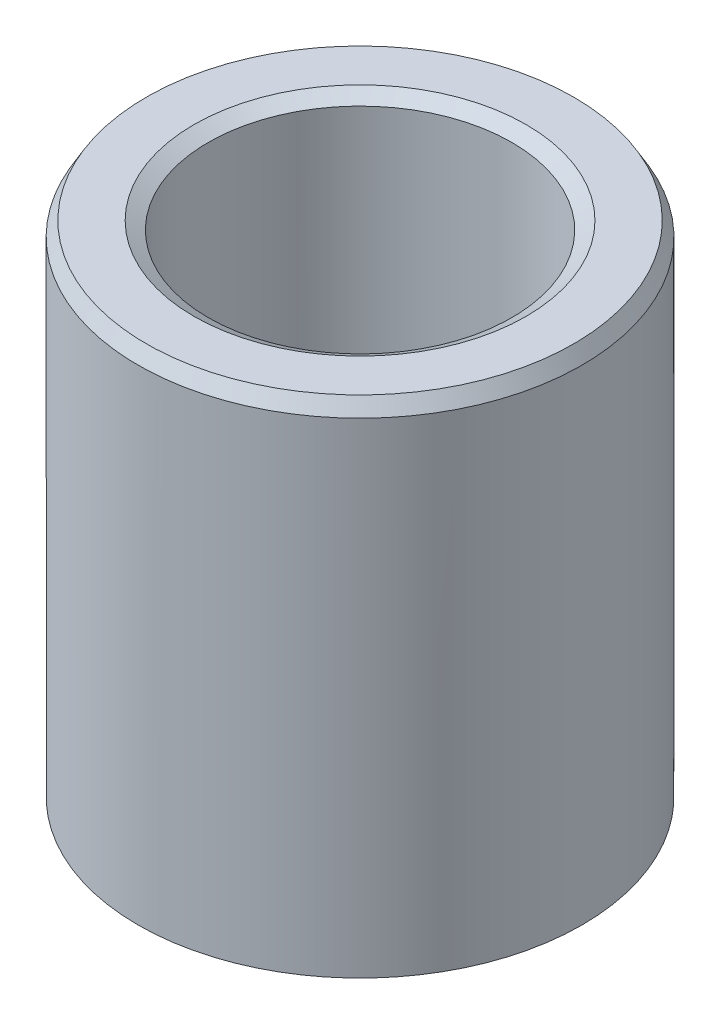
ISO-10303-21;
HEADER;
FILE_DESCRIPTION(('STEP AP214'),'2;1');
FILE_NAME('part.step','',(''),(''),'','','');
FILE_SCHEMA(('AUTOMOTIVE_DESIGN { 1 0 10303 214 1 1 1 1 }'));
ENDSEC;
DATA;
#1=APPLICATION_CONTEXT('core data for automotive mechanical design processes');
#2=APPLICATION_PROTOCOL_DEFINITION('international standard','automotive_design',2000,#1);
#3=PRODUCT_CONTEXT('',#1,'mechanical');
#4=PRODUCT('Part','Part','',(#3));
#5=PRODUCT_RELATED_PRODUCT_CATEGORY('part','',(#4));
#6=PRODUCT_DEFINITION_FORMATION('','',#4);
#7=PRODUCT_DEFINITION_CONTEXT('part definition',#1,'design');
#8=PRODUCT_DEFINITION('design','',#6,#7);
#9=PRODUCT_DEFINITION_SHAPE('','',#8);
#10=(LENGTH_UNIT() NAMED_UNIT(*) SI_UNIT(.MILLI.,.METRE.));
#11=(NAMED_UNIT(*) PLANE_ANGLE_UNIT() SI_UNIT($,.RADIAN.));
#12=(NAMED_UNIT(*) SI_UNIT($,.STERADIAN.) SOLID_ANGLE_UNIT());
#13=UNCERTAINTY_MEASURE_WITH_UNIT(LENGTH_MEASURE(1.E-05),#10,'distance_accuracy_value','');
#14=(GEOMETRIC_REPRESENTATION_CONTEXT(3) GLOBAL_UNCERTAINTY_ASSIGNED_CONTEXT((#13)) GLOBAL_UNIT_ASSIGNED_CONTEXT((#10,
#11,#12)) REPRESENTATION_CONTEXT('',''));
#15=CARTESIAN_POINT('',(0.,0.,0.));
#16=DIRECTION('',(0.,0.,1.));
#17=DIRECTION('',(1.,0.,0.));
#18=AXIS2_PLACEMENT_3D('',#15,#16,#17);
#19=CARTESIAN_POINT('',(0.,102.878784980708,0.));
#20=DIRECTION('',(0.,-1.,0.));
#21=DIRECTION('',(0.,0.,-1.));
#22=AXIS2_PLACEMENT_3D('',#19,#20,#21);
#23=CYLINDRICAL_SURFACE('',#22,45.);
#24=CARTESIAN_POINT('',(0.,1.67618103833647,0.));
#25=DIRECTION('',(0.,1.,0.));
#26=DIRECTION('',(0.,0.,1.));
#27=AXIS2_PLACEMENT_3D('',#24,#25,#26);
#28=CIRCLE('',#27,45.);
#29=CARTESIAN_POINT('',(0.,1.67618103833647,45.));
#30=VERTEX_POINT('',#29);
#31=EDGE_CURVE('E10',#30,#30,#28,.T.);
#32=ORIENTED_EDGE('',*,*,#31,.T.);
#33=EDGE_LOOP('',(#32));
#34=FACE_BOUND('',#33,.T.);
#35=CARTESIAN_POINT('',(0.,99.9755542596259,0.));
#36=DIRECTION('',(0.,1.,0.));
#37=DIRECTION('',(0.,0.,1.));
#38=AXIS2_PLACEMENT_3D('',#35,#36,#37);
#39=CIRCLE('',#38,45.);
#40=CARTESIAN_POINT('',(0.,99.9755542596259,-45.));
#41=VERTEX_POINT('',#40);
#42=EDGE_CURVE('E50',#41,#41,#39,.F.);
#43=ORIENTED_EDGE('',*,*,#42,.T.);
#44=EDGE_LOOP('',(#43));
#45=FACE_BOUND('',#44,.T.);
#46=ADVANCED_FACE('F39',(#34,#45),#23,.T.);
#47=CARTESIAN_POINT('',(0.,102.878784980708,0.));
#48=DIRECTION('',(0.,1.,0.));
#49=DIRECTION('',(0.,0.,1.));
#50=AXIS2_PLACEMENT_3D('',#47,#48,#49);
#51=PLANE('',#50);
#52=CARTESIAN_POINT('',(0.,102.878784980708,0.));
#53=DIRECTION('',(0.,1.,0.));
#54=DIRECTION('',(0.,0.,1.));
#55=AXIS2_PLACEMENT_3D('',#52,#53,#54);
#56=CIRCLE('',#55,33.6783897348764);
#57=CARTESIAN_POINT('',(0.,102.878784980708,33.6783897348764));
#58=VERTEX_POINT('',#57);
#59=EDGE_CURVE('E58',#58,#58,#56,.F.);
#60=ORIENTED_EDGE('',*,*,#59,.T.);
#61=EDGE_LOOP('',(#60));
#62=FACE_BOUND('',#61,.T.);
#63=CARTESIAN_POINT('',(0.,102.878784980708,0.));
#64=DIRECTION('',(0.,1.,0.));
#65=DIRECTION('',(0.,0.,1.));
#66=AXIS2_PLACEMENT_3D('',#63,#64,#65);
#67=CIRCLE('',#66,43.3238189616636);
#68=CARTESIAN_POINT('',(0.,102.878784980708,-43.3238189616636));
#69=VERTEX_POINT('',#68);
#70=EDGE_CURVE('E61',#69,#69,#67,.T.);
#71=ORIENTED_EDGE('',*,*,#70,.T.);
#72=EDGE_LOOP('',(#71));
#73=FACE_BOUND('',#72,.T.);
#74=ADVANCED_FACE('F88',(#62,#73),#51,.T.);
#75=CARTESIAN_POINT('',(0.,0.,0.));
#76=DIRECTION('',(0.,1.,0.));
#77=DIRECTION('',(0.,0.,1.));
#78=AXIS2_PLACEMENT_3D('',#75,#76,#77);
#79=PLANE('',#78);
#80=CARTESIAN_POINT('',(0.,0.,0.));
#81=DIRECTION('',(0.,1.,0.));
#82=DIRECTION('',(0.,0.,1.));
#83=AXIS2_PLACEMENT_3D('',#80,#81,#82);
#84=CIRCLE('',#83,32.4513400521305);
#85=CARTESIAN_POINT('',(0.,0.,-32.4513400521305));
#86=VERTEX_POINT('',#85);
#87=EDGE_CURVE('E51',#86,#86,#84,.T.);
#88=ORIENTED_EDGE('',*,*,#87,.T.);
#89=EDGE_LOOP('',(#88));
#90=FACE_BOUND('',#89,.T.);
#91=CARTESIAN_POINT('',(0.,0.,0.));
#92=DIRECTION('',(0.,1.,0.));
#93=DIRECTION('',(0.,0.,1.));
#94=AXIS2_PLACEMENT_3D('',#91,#92,#93);
#95=CIRCLE('',#94,42.0967692789177);
#96=CARTESIAN_POINT('',(0.,0.,42.0967692789177));
#97=VERTEX_POINT('',#96);
#98=EDGE_CURVE('E54',#97,#97,#95,.F.);
#99=ORIENTED_EDGE('',*,*,#98,.T.);
#100=EDGE_LOOP('',(#99));
#101=FACE_BOUND('',#100,.T.);
#102=ADVANCED_FACE('F83',(#90,#101),#79,.F.);
#103=CARTESIAN_POINT('',(0.,102.878784980708,0.));
#104=DIRECTION('',(0.,-1.,0.));
#105=DIRECTION('',(0.,0.,-1.));
#106=AXIS2_PLACEMENT_3D('',#103,#104,#105);
#107=CYLINDRICAL_SURFACE('',#106,30.7751590137941);
#108=CARTESIAN_POINT('',(0.,101.202603942372,0.));
#109=DIRECTION('',(0.,1.,0.));
#110=DIRECTION('',(0.,0.,1.));
#111=AXIS2_PLACEMENT_3D('',#108,#109,#110);
#112=CIRCLE('',#111,30.7751590137941);
#113=CARTESIAN_POINT('',(0.,101.202603942372,30.7751590137941));
#114=VERTEX_POINT('',#113);
#115=EDGE_CURVE('E67',#114,#114,#112,.T.);
#116=ORIENTED_EDGE('',*,*,#115,.T.);
#117=EDGE_LOOP('',(#116));
#118=FACE_BOUND('',#117,.T.);
#119=CARTESIAN_POINT('',(0.,2.90323072108231,0.));
#120=DIRECTION('',(0.,1.,0.));
#121=DIRECTION('',(0.,0.,1.));
#122=AXIS2_PLACEMENT_3D('',#119,#120,#121);
#123=CIRCLE('',#122,30.7751590137941);
#124=CARTESIAN_POINT('',(0.,2.90323072108231,-30.7751590137941));
#125=VERTEX_POINT('',#124);
#126=EDGE_CURVE('E69',#125,#125,#123,.F.);
#127=ORIENTED_EDGE('',*,*,#126,.T.);
#128=EDGE_LOOP('',(#127));
#129=FACE_BOUND('',#128,.T.);
#130=ADVANCED_FACE('F71',(#118,#129),#107,.F.);
#131=CARTESIAN_POINT('',(0.,101.202603942372,0.));
#132=DIRECTION('',(0.,1.,0.));
#133=DIRECTION('',(0.,0.,1.));
#134=AXIS2_PLACEMENT_3D('',#131,#132,#133);
#135=CONICAL_SURFACE('',#134,30.7751590137941,1.0471975511966);
#136=ORIENTED_EDGE('',*,*,#59,.F.);
#137=EDGE_LOOP('',(#136));
#138=FACE_BOUND('',#137,.T.);
#139=ORIENTED_EDGE('',*,*,#115,.F.);
#140=EDGE_LOOP('',(#139));
#141=FACE_BOUND('',#140,.T.);
#142=ADVANCED_FACE('F77',(#138,#141),#135,.F.);
#143=CARTESIAN_POINT('',(0.,0.,0.));
#144=DIRECTION('',(0.,-1.,0.));
#145=DIRECTION('',(0.,0.,-1.));
#146=AXIS2_PLACEMENT_3D('',#143,#144,#145);
#147=CONICAL_SURFACE('',#146,32.4513400521305,0.523598775598297);
#148=CARTESIAN_POINT('',(0.,2.90323072108231,-30.7751590137941));
#149=CARTESIAN_POINT('',(0.,2.87298873440437,-30.7926192329434));
#150=CARTESIAN_POINT('',(0.,2.84274674772643,-30.8100794520927));
#151=CARTESIAN_POINT('',(0.,2.78226277437055,-30.8449998903914));
#152=CARTESIAN_POINT('',(0.,2.75202078769261,-30.8624601095407));
#153=CARTESIAN_POINT('',(0.,2.69153681433673,-30.8973805478394));
#154=CARTESIAN_POINT('',(0.,2.66129482765879,-30.9148407669888));
#155=CARTESIAN_POINT('',(0.,2.6008108543029,-30.9497612052874));
#156=CARTESIAN_POINT('',(0.,2.57056886762496,-30.9672214244368));
#157=CARTESIAN_POINT('',(0.,2.51008489426908,-31.0021418627355));
#158=CARTESIAN_POINT('',(0.,2.47984290759114,-31.0196020818848));
#159=CARTESIAN_POINT('',(0.,2.41935893423526,-31.0545225201835));
#160=CARTESIAN_POINT('',(0.,2.38911694755732,-31.0719827393328));
#161=CARTESIAN_POINT('',(0.,2.32863297420144,-31.1069031776315));
#162=CARTESIAN_POINT('',(0.,2.2983909875235,-31.1243633967808));
#163=CARTESIAN_POINT('',(0.,2.23790701416761,-31.1592838350795));
#164=CARTESIAN_POINT('',(0.,2.20766502748967,-31.1767440542288));
#165=CARTESIAN_POINT('',(0.,2.14718105413379,-31.2116644925275));
#166=CARTESIAN_POINT('',(0.,2.11693906745585,-31.2291247116768));
#167=CARTESIAN_POINT('',(0.,2.05645509409997,-31.2640451499755));
#168=CARTESIAN_POINT('',(0.,2.02621310742203,-31.2815053691249));
#169=CARTESIAN_POINT('',(0.,1.96572913406615,-31.3164258074235));
#170=CARTESIAN_POINT('',(0.,1.93548714738821,-31.3338860265729));
#171=CARTESIAN_POINT('',(0.,1.87500317403233,-31.3688064648716));
#172=CARTESIAN_POINT('',(0.,1.84476118735439,-31.3862666840209));
#173=CARTESIAN_POINT('',(0.,1.7842772139985,-31.4211871223196));
#174=CARTESIAN_POINT('',(0.,1.75403522732056,-31.4386473414689));
#175=CARTESIAN_POINT('',(0.,1.69355125396468,-31.4735677797676));
#176=CARTESIAN_POINT('',(0.,1.66330926728674,-31.4910279989169));
#177=CARTESIAN_POINT('',(0.,1.60282529393086,-31.5259484372156));
#178=CARTESIAN_POINT('',(0.,1.57258330725292,-31.5434086563649));
#179=CARTESIAN_POINT('',(0.,1.51209933389704,-31.5783290946636));
#180=CARTESIAN_POINT('',(0.,1.4818573472191,-31.5957893138129));
#181=CARTESIAN_POINT('',(0.,1.42137337386322,-31.6307097521116));
#182=CARTESIAN_POINT('',(0.,1.39113138718527,-31.648169971261));
#183=CARTESIAN_POINT('',(0.,1.33064741382939,-31.6830904095596));
#184=CARTESIAN_POINT('',(0.,1.30040542715145,-31.700550628709));
#185=CARTESIAN_POINT('',(0.,1.23992145379557,-31.7354710670077));
#186=CARTESIAN_POINT('',(0.,1.20967946711763,-31.752931286157));
#187=CARTESIAN_POINT('',(0.,1.14919549376175,-31.7878517244557));
#188=CARTESIAN_POINT('',(0.,1.11895350708381,-31.805311943605));
#189=CARTESIAN_POINT('',(0.,1.05846953372793,-31.8402323819037));
#190=CARTESIAN_POINT('',(0.,1.02822754704999,-31.857692601053));
#191=CARTESIAN_POINT('',(0.,0.967743573694104,-31.8926130393517));
#192=CARTESIAN_POINT('',(0.,0.937501587016163,-31.910073258501));
#193=CARTESIAN_POINT('',(0.,0.877017613660281,-31.9449936967997));
#194=CARTESIAN_POINT('',(0.,0.84677562698234,-31.962453915949));
#195=CARTESIAN_POINT('',(0.,0.78629165362646,-31.9973743542477));
#196=CARTESIAN_POINT('',(0.,0.756049666948519,-32.0148345733971));
#197=CARTESIAN_POINT('',(0.,0.695565693592637,-32.0497550116957));
#198=CARTESIAN_POINT('',(0.,0.665323706914696,-32.0672152308451));
#199=CARTESIAN_POINT('',(0.,0.604839733558814,-32.1021356691438));
#200=CARTESIAN_POINT('',(0.,0.574597746880875,-32.1195958882931));
#201=CARTESIAN_POINT('',(0.,0.514113773524993,-32.1545163265918));
#202=CARTESIAN_POINT('',(0.,0.483871786847051,-32.1719765457411));
#203=CARTESIAN_POINT('',(0.,0.42338781349117,-32.2068969840398));
#204=CARTESIAN_POINT('',(0.,0.39314582681323,-32.2243572031891));
#205=CARTESIAN_POINT('',(0.,0.332661853457349,-32.2592776414878));
#206=CARTESIAN_POINT('',(0.,0.302419866779407,-32.2767378606371));
#207=CARTESIAN_POINT('',(0.,0.241935893423525,-32.3116582989358));
#208=CARTESIAN_POINT('',(0.,0.211693906745586,-32.3291185180851));
#209=CARTESIAN_POINT('',(0.,0.151209933389704,-32.3640389563838));
#210=CARTESIAN_POINT('',(0.,0.120967946711763,-32.3814991755332));
#211=CARTESIAN_POINT('',(0.,0.0604839733558804,-32.4164196138318));
#212=CARTESIAN_POINT('',(0.,0.030241986677939,-32.4338798329812));
#213=CARTESIAN_POINT('',(0.,0.,-32.4513400521305));
#214=B_SPLINE_CURVE_WITH_KNOTS('',3,(#148,#149,#150,#151,#152,#153,#154,#155,#156,#157,#158,
#159,#160,#161,#162,#163,#164,#165,#166,#167,#168,#169,#170,#171,#172,#173,#174,#175,#176,#177,
#178,#179,#180,#181,#182,#183,#184,#185,#186,#187,#188,#189,#190,#191,#192,#193,#194,#195,#196,
#197,#198,#199,#200,#201,#202,#203,#204,#205,#206,#207,#208,#209,#210,#211,#212,#213),
.UNSPECIFIED.,.F.,.F.,(4,2,2,2,2,2,2,2,2,2,2,2,2,2,2,2,2,2,2,2,2,2,2,2,2,2,2,2,2,2,2,2,4),(0.,
0.104761314896029,0.209522629792057,0.314283944688086,0.419045259584115,0.523806574480145,
0.628567889376174,0.733329204272203,0.838090519168231,0.94285183406426,1.04761314896029,
1.15237446385632,1.25713577875235,1.36189709364837,1.4666584085444,1.57141972344043,
1.67618103833646,1.78094235323249,1.88570366812852,1.99046498302455,2.09522629792058,
2.19998761281661,2.30474892771263,2.40951024260866,2.51427155750469,2.61903287240072,
2.72379418729675,2.82855550219278,2.93331681708881,3.03807813198484,3.14283944688087,
3.24760076177689,3.35236207667292),.UNSPECIFIED.);
#215=EDGE_CURVE('BSEAM73',#125,#86,#214,.T.);
#216=ORIENTED_EDGE('',*,*,#126,.F.);
#217=ORIENTED_EDGE('',*,*,#87,.F.);
#218=ORIENTED_EDGE('',*,*,#215,.T.);
#219=ORIENTED_EDGE('',*,*,#215,.F.);
#220=EDGE_LOOP('',(#216,#218,#217,#219));
#221=FACE_BOUND('',#220,.T.);
#222=ADVANCED_FACE('F73',(#221),#147,.F.);
#223=CARTESIAN_POINT('',(0.,1.67618103833647,0.));
#224=DIRECTION('',(0.,1.,0.));
#225=DIRECTION('',(0.,0.,1.));
#226=AXIS2_PLACEMENT_3D('',#223,#224,#225);
#227=CONICAL_SURFACE('',#226,45.,1.0471975511966);
#228=ORIENTED_EDGE('',*,*,#98,.F.);
#229=EDGE_LOOP('',(#228));
#230=FACE_BOUND('',#229,.T.);
#231=ORIENTED_EDGE('',*,*,#31,.F.);
#232=EDGE_LOOP('',(#231));
#233=FACE_BOUND('',#232,.T.);
#234=ADVANCED_FACE('F76',(#230,#233),#227,.T.);
#235=CARTESIAN_POINT('',(0.,102.878784980708,0.));
#236=DIRECTION('',(0.,-1.,0.));
#237=DIRECTION('',(0.,0.,-1.));
#238=AXIS2_PLACEMENT_3D('',#235,#236,#237);
#239=CONICAL_SURFACE('',#238,43.3238189616636,0.523598775598297);
#240=CARTESIAN_POINT('',(0.,99.9755542596259,-45.));
#241=CARTESIAN_POINT('',(0.,100.005796246304,-44.9825397808507));
#242=CARTESIAN_POINT('',(0.,100.036038232982,-44.9650795617013));
#243=CARTESIAN_POINT('',(0.,100.096522206338,-44.9301591234027));
#244=CARTESIAN_POINT('',(0.,100.126764193016,-44.9126989042533));
#245=CARTESIAN_POINT('',(0.,100.187248166371,-44.8777784659546));
#246=CARTESIAN_POINT('',(0.,100.217490153049,-44.8603182468053));
#247=CARTESIAN_POINT('',(0.,100.277974126405,-44.8253978085066));
#248=CARTESIAN_POINT('',(0.,100.308216113083,-44.8079375893573));
#249=CARTESIAN_POINT('',(0.,100.368700086439,-44.7730171510586));
#250=CARTESIAN_POINT('',(0.,100.398942073117,-44.7555569319093));
#251=CARTESIAN_POINT('',(0.,100.459426046473,-44.7206364936106));
#252=CARTESIAN_POINT('',(0.,100.489668033151,-44.7031762744613));
#253=CARTESIAN_POINT('',(0.,100.550152006507,-44.6682558361626));
#254=CARTESIAN_POINT('',(0.,100.580393993185,-44.6507956170133));
#255=CARTESIAN_POINT('',(0.,100.640877966541,-44.6158751787146));
#256=CARTESIAN_POINT('',(0.,100.671119953219,-44.5984149595652));
#257=CARTESIAN_POINT('',(0.,100.731603926574,-44.5634945212666));
#258=CARTESIAN_POINT('',(0.,100.761845913252,-44.5460343021172));
#259=CARTESIAN_POINT('',(0.,100.822329886608,-44.5111138638186));
#260=CARTESIAN_POINT('',(0.,100.852571873286,-44.4936536446692));
#261=CARTESIAN_POINT('',(0.,100.913055846642,-44.4587332063705));
#262=CARTESIAN_POINT('',(0.,100.94329783332,-44.4412729872212));
#263=CARTESIAN_POINT('',(0.,101.003781806676,-44.4063525489225));
#264=CARTESIAN_POINT('',(0.,101.034023793354,-44.3888923297732));
#265=CARTESIAN_POINT('',(0.,101.09450776671,-44.3539718914745));
#266=CARTESIAN_POINT('',(0.,101.124749753388,-44.3365116723252));
#267=CARTESIAN_POINT('',(0.,101.185233726744,-44.3015912340265));
#268=CARTESIAN_POINT('',(0.,101.215475713421,-44.2841310148772));
#269=CARTESIAN_POINT('',(0.,101.275959686777,-44.2492105765785));
#270=CARTESIAN_POINT('',(0.,101.306201673455,-44.2317503574292));
#271=CARTESIAN_POINT('',(0.,101.366685646811,-44.1968299191305));
#272=CARTESIAN_POINT('',(0.,101.396927633489,-44.1793696999811));
#273=CARTESIAN_POINT('',(0.,101.457411606845,-44.1444492616825));
#274=CARTESIAN_POINT('',(0.,101.487653593523,-44.1269890425331));
#275=CARTESIAN_POINT('',(0.,101.548137566879,-44.0920686042345));
#276=CARTESIAN_POINT('',(0.,101.578379553557,-44.0746083850851));
#277=CARTESIAN_POINT('',(0.,101.638863526913,-44.0396879467864));
#278=CARTESIAN_POINT('',(0.,101.669105513591,-44.0222277276371));
#279=CARTESIAN_POINT('',(0.,101.729589486946,-43.9873072893384));
#280=CARTESIAN_POINT('',(0.,101.759831473624,-43.9698470701891));
#281=CARTESIAN_POINT('',(0.,101.82031544698,-43.9349266318904));
#282=CARTESIAN_POINT('',(0.,101.850557433658,-43.9174664127411));
#283=CARTESIAN_POINT('',(0.,101.911041407014,-43.8825459744424));
#284=CARTESIAN_POINT('',(0.,101.941283393692,-43.8650857552931));
#285=CARTESIAN_POINT('',(0.,102.001767367048,-43.8301653169944));
#286=CARTESIAN_POINT('',(0.,102.032009353726,-43.812705097845));
#287=CARTESIAN_POINT('',(0.,102.092493327082,-43.7777846595464));
#288=CARTESIAN_POINT('',(0.,102.12273531376,-43.760324440397));
#289=CARTESIAN_POINT('',(0.,102.183219287116,-43.7254040020984));
#290=CARTESIAN_POINT('',(0.,102.213461273793,-43.707943782949));
#291=CARTESIAN_POINT('',(0.,102.273945247149,-43.6730233446503));
#292=CARTESIAN_POINT('',(0.,102.304187233827,-43.655563125501));
#293=CARTESIAN_POINT('',(0.,102.364671207183,-43.6206426872023));
#294=CARTESIAN_POINT('',(0.,102.394913193861,-43.603182468053));
#295=CARTESIAN_POINT('',(0.,102.455397167217,-43.5682620297543));
#296=CARTESIAN_POINT('',(0.,102.485639153895,-43.550801810605));
#297=CARTESIAN_POINT('',(0.,102.546123127251,-43.5158813723063));
#298=CARTESIAN_POINT('',(0.,102.576365113929,-43.498421153157));
#299=CARTESIAN_POINT('',(0.,102.636849087285,-43.4635007148583));
#300=CARTESIAN_POINT('',(0.,102.667091073963,-43.4460404957089));
#301=CARTESIAN_POINT('',(0.,102.727575047318,-43.4111200574103));
#302=CARTESIAN_POINT('',(0.,102.757817033996,-43.3936598382609));
#303=CARTESIAN_POINT('',(0.,102.818301007352,-43.3587393999623));
#304=CARTESIAN_POINT('',(0.,102.84854299403,-43.3412791808129));
#305=CARTESIAN_POINT('',(0.,102.878784980708,-43.3238189616636));
#306=B_SPLINE_CURVE_WITH_KNOTS('',3,(#240,#241,#242,#243,#244,#245,#246,#247,#248,#249,#250,
#251,#252,#253,#254,#255,#256,#257,#258,#259,#260,#261,#262,#263,#264,#265,#266,#267,#268,#269,
#270,#271,#272,#273,#274,#275,#276,#277,#278,#279,#280,#281,#282,#283,#284,#285,#286,#287,#288,
#289,#290,#291,#292,#293,#294,#295,#296,#297,#298,#299,#300,#301,#302,#303,#304,#305),
.UNSPECIFIED.,.F.,.F.,(4,2,2,2,2,2,2,2,2,2,2,2,2,2,2,2,2,2,2,2,2,2,2,2,2,2,2,2,2,2,2,2,4),(0.,
0.104761314896037,0.209522629792059,0.314283944688084,0.419045259584118,0.523806574480139,
0.628567889376164,0.733329204272198,0.838090519168223,0.942851834064245,1.04761314896028,
1.1523744638563,1.25713577875233,1.36189709364836,1.46665840854438,1.57141972344041,
1.67618103833643,1.78094235323247,1.88570366812849,1.99046498302451,2.09522629792055,
2.19998761281657,2.30474892771259,2.40951024260863,2.51427155750465,2.61903287240068,
2.72379418729671,2.82855550219273,2.93331681708876,3.03807813198479,3.14283944688082,
3.24760076177684,3.35236207667287),.UNSPECIFIED.);
#307=EDGE_CURVE('BSEAM45',#41,#69,#306,.T.);
#308=ORIENTED_EDGE('',*,*,#42,.F.);
#309=ORIENTED_EDGE('',*,*,#70,.F.);
#310=ORIENTED_EDGE('',*,*,#307,.T.);
#311=ORIENTED_EDGE('',*,*,#307,.F.);
#312=EDGE_LOOP('',(#308,#310,#309,#311));
#313=FACE_BOUND('',#312,.T.);
#314=ADVANCED_FACE('F45',(#313),#239,.T.);
#315=CLOSED_SHELL('',(#46,#74,#102,#130,#142,#222,#234,#314));
#316=MANIFOLD_SOLID_BREP('B2',#315);
#317=ADVANCED_BREP_SHAPE_REPRESENTATION('',(#18,#316),#14);
#318=SHAPE_DEFINITION_REPRESENTATION(#9,#317);
ENDSEC;
END-ISO-10303-21;
